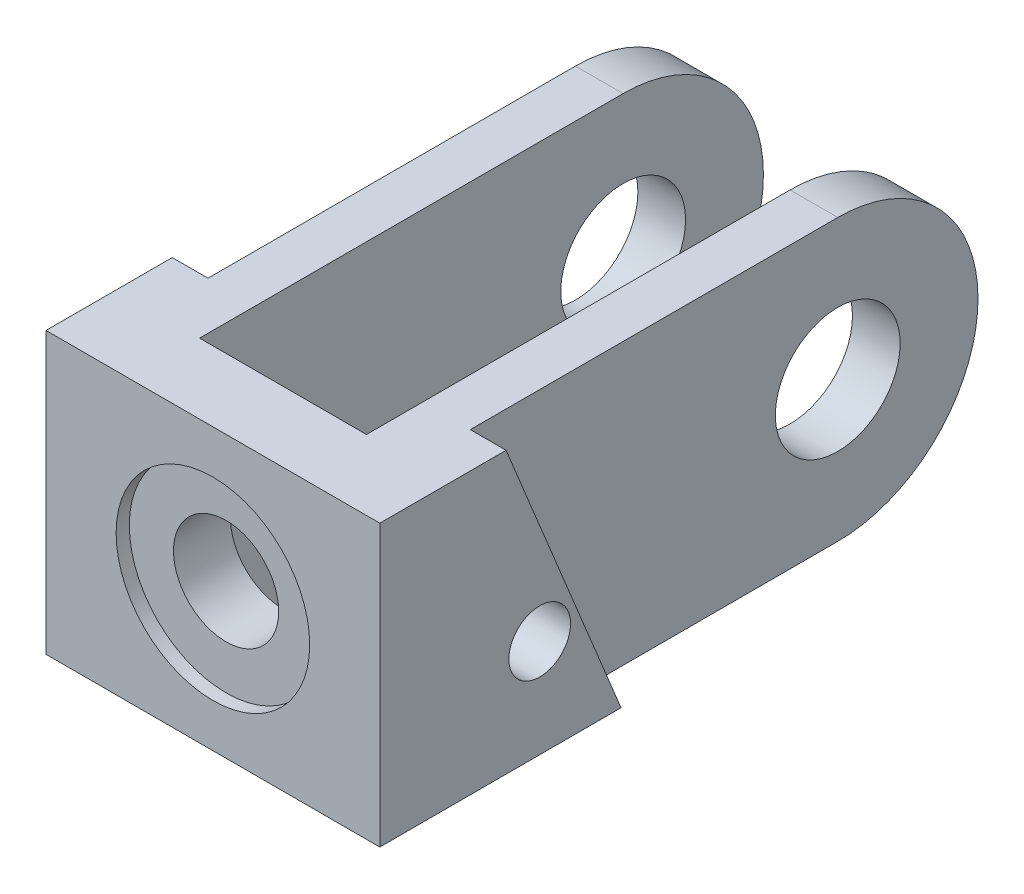
ISO-10303-21;
HEADER;
FILE_DESCRIPTION(('STEP AP214'),'2;1');
FILE_NAME('part.step','',(''),(''),'','','');
FILE_SCHEMA(('AUTOMOTIVE_DESIGN { 1 0 10303 214 1 1 1 1 }'));
ENDSEC;
DATA;
#1=APPLICATION_CONTEXT('core data for automotive mechanical design processes');
#2=APPLICATION_PROTOCOL_DEFINITION('international standard','automotive_design',2000,#1);
#3=PRODUCT_CONTEXT('',#1,'mechanical');
#4=PRODUCT('Part','Part','',(#3));
#5=PRODUCT_RELATED_PRODUCT_CATEGORY('part','',(#4));
#6=PRODUCT_DEFINITION_FORMATION('','',#4);
#7=PRODUCT_DEFINITION_CONTEXT('part definition',#1,'design');
#8=PRODUCT_DEFINITION('design','',#6,#7);
#9=PRODUCT_DEFINITION_SHAPE('','',#8);
#10=(LENGTH_UNIT() NAMED_UNIT(*) SI_UNIT(.MILLI.,.METRE.));
#11=(NAMED_UNIT(*) PLANE_ANGLE_UNIT() SI_UNIT($,.RADIAN.));
#12=(NAMED_UNIT(*) SI_UNIT($,.STERADIAN.) SOLID_ANGLE_UNIT());
#13=UNCERTAINTY_MEASURE_WITH_UNIT(LENGTH_MEASURE(1.E-05),#10,'distance_accuracy_value','');
#14=(GEOMETRIC_REPRESENTATION_CONTEXT(3) GLOBAL_UNCERTAINTY_ASSIGNED_CONTEXT((#13)) GLOBAL_UNIT_ASSIGNED_CONTEXT((#10,
#11,#12)) REPRESENTATION_CONTEXT('',''));
#15=CARTESIAN_POINT('',(0.,0.,0.));
#16=DIRECTION('',(0.,0.,1.));
#17=DIRECTION('',(1.,0.,0.));
#18=AXIS2_PLACEMENT_3D('',#15,#16,#17);
#19=CARTESIAN_POINT('',(0.,25.4,-114.808));
#20=DIRECTION('',(0.,0.,1.));
#21=DIRECTION('',(1.,0.,0.));
#22=AXIS2_PLACEMENT_3D('',#19,#20,#21);
#23=CYLINDRICAL_SURFACE('',#22,9.525);
#24=CARTESIAN_POINT('',(0.,25.4,-12.7));
#25=DIRECTION('',(0.,0.,-1.));
#26=DIRECTION('',(0.,1.,0.));
#27=AXIS2_PLACEMENT_3D('',#24,#25,#26);
#28=CIRCLE('',#27,9.525);
#29=CARTESIAN_POINT('',(0.,34.925,-12.7));
#30=VERTEX_POINT('',#29);
#31=EDGE_CURVE('E159',#30,#30,#28,.T.);
#32=ORIENTED_EDGE('',*,*,#31,.T.);
#33=EDGE_LOOP('',(#32));
#34=FACE_BOUND('',#33,.T.);
#35=CARTESIAN_POINT('',(0.,25.4,-2.3876));
#36=DIRECTION('',(0.,0.,1.));
#37=DIRECTION('',(1.,0.,0.));
#38=AXIS2_PLACEMENT_3D('',#35,#36,#37);
#39=CIRCLE('',#38,9.525);
#40=CARTESIAN_POINT('',(9.525,25.4,-2.3876));
#41=VERTEX_POINT('',#40);
#42=EDGE_CURVE('E39',#41,#41,#39,.F.);
#43=ORIENTED_EDGE('',*,*,#42,.F.);
#44=EDGE_LOOP('',(#43));
#45=FACE_BOUND('',#44,.T.);
#46=ADVANCED_FACE('F35',(#34,#45),#23,.F.);
#47=CARTESIAN_POINT('',(-23.749,0.,0.));
#48=DIRECTION('',(-1.,0.,0.));
#49=DIRECTION('',(0.,0.,-1.));
#50=AXIS2_PLACEMENT_3D('',#47,#48,#49);
#51=PLANE('',#50);
#52=CARTESIAN_POINT('',(-23.749,25.4,-89.408));
#53=DIRECTION('',(1.,0.,0.));
#54=DIRECTION('',(0.,0.,-1.));
#55=AXIS2_PLACEMENT_3D('',#52,#53,#54);
#56=CIRCLE('',#55,11.303);
#57=CARTESIAN_POINT('',(-23.749,25.4,-100.711));
#58=VERTEX_POINT('',#57);
#59=EDGE_CURVE('E294',#58,#58,#56,.T.);
#60=ORIENTED_EDGE('',*,*,#59,.T.);
#61=EDGE_LOOP('',(#60));
#62=FACE_BOUND('',#61,.T.);
#63=DIRECTION('',(0.,0.,-1.));
#64=VECTOR('',#63,1.);
#65=CARTESIAN_POINT('',(-23.749,0.,0.));
#66=LINE('',#65,#64);
#67=CARTESIAN_POINT('',(-23.749,0.,-43.688));
#68=VERTEX_POINT('',#67);
#69=CARTESIAN_POINT('',(-23.749,0.,-89.408));
#70=VERTEX_POINT('',#69);
#71=EDGE_CURVE('E169',#68,#70,#66,.T.);
#72=ORIENTED_EDGE('',*,*,#71,.F.);
#73=DIRECTION('',(0.,0.9252519052084,0.379353281135444));
#74=VECTOR('',#73,1.);
#75=CARTESIAN_POINT('',(-23.749,15.3343720571869,-37.4009074565534));
#76=LINE('',#75,#74);
#77=CARTESIAN_POINT('',(-23.749,50.8,-22.86));
#78=VERTEX_POINT('',#77);
#79=EDGE_CURVE('E157',#68,#78,#76,.T.);
#80=ORIENTED_EDGE('',*,*,#79,.T.);
#81=DIRECTION('',(0.,0.,-1.));
#82=VECTOR('',#81,1.);
#83=CARTESIAN_POINT('',(-23.749,50.8,0.));
#84=LINE('',#83,#82);
#85=CARTESIAN_POINT('',(-23.749,50.8,-89.408));
#86=VERTEX_POINT('',#85);
#87=EDGE_CURVE('E131',#78,#86,#84,.T.);
#88=ORIENTED_EDGE('',*,*,#87,.T.);
#89=CARTESIAN_POINT('',(-23.749,25.4,-89.408));
#90=DIRECTION('',(1.,0.,0.));
#91=DIRECTION('',(0.,0.,-1.));
#92=AXIS2_PLACEMENT_3D('',#89,#90,#91);
#93=CIRCLE('',#92,25.4);
#94=EDGE_CURVE('E175',#70,#86,#93,.T.);
#95=ORIENTED_EDGE('',*,*,#94,.F.);
#96=EDGE_LOOP('',(#72,#80,#88,#95));
#97=FACE_BOUND('',#96,.T.);
#98=ADVANCED_FACE('F173',(#62,#97),#51,.T.);
#99=CARTESIAN_POINT('',(15.113,0.,-12.7));
#100=DIRECTION('',(0.,0.,-1.));
#101=DIRECTION('',(0.,1.,0.));
#102=AXIS2_PLACEMENT_3D('',#99,#100,#101);
#103=PLANE('',#102);
#104=ORIENTED_EDGE('',*,*,#31,.F.);
#105=EDGE_LOOP('',(#104));
#106=FACE_BOUND('',#105,.T.);
#107=DIRECTION('',(-1.,0.,0.));
#108=VECTOR('',#107,1.);
#109=CARTESIAN_POINT('',(15.113,0.,-12.7));
#110=LINE('',#109,#108);
#111=CARTESIAN_POINT('',(15.113,0.,-12.7));
#112=VERTEX_POINT('',#111);
#113=CARTESIAN_POINT('',(-15.113,0.,-12.7));
#114=VERTEX_POINT('',#113);
#115=EDGE_CURVE('E271',#112,#114,#110,.T.);
#116=ORIENTED_EDGE('',*,*,#115,.T.);
#117=DIRECTION('',(0.,-1.,0.));
#118=VECTOR('',#117,1.);
#119=CARTESIAN_POINT('',(-15.113,0.,-12.7));
#120=LINE('',#119,#118);
#121=CARTESIAN_POINT('',(-15.113,50.8,-12.7));
#122=VERTEX_POINT('',#121);
#123=EDGE_CURVE('E181',#122,#114,#120,.T.);
#124=ORIENTED_EDGE('',*,*,#123,.F.);
#125=DIRECTION('',(-1.,0.,0.));
#126=VECTOR('',#125,1.);
#127=CARTESIAN_POINT('',(15.113,50.8,-12.7));
#128=LINE('',#127,#126);
#129=CARTESIAN_POINT('',(15.113,50.8,-12.7));
#130=VERTEX_POINT('',#129);
#131=EDGE_CURVE('E11',#130,#122,#128,.T.);
#132=ORIENTED_EDGE('',*,*,#131,.F.);
#133=DIRECTION('',(0.,-1.,0.));
#134=VECTOR('',#133,1.);
#135=CARTESIAN_POINT('',(15.113,0.,-12.7));
#136=LINE('',#135,#134);
#137=EDGE_CURVE('E258',#130,#112,#136,.T.);
#138=ORIENTED_EDGE('',*,*,#137,.T.);
#139=EDGE_LOOP('',(#116,#124,#132,#138));
#140=FACE_BOUND('',#139,.T.);
#141=ADVANCED_FACE('F37',(#106,#140),#103,.T.);
#142=CARTESIAN_POINT('',(15.113,50.8,0.));
#143=DIRECTION('',(0.,-1.,0.));
#144=DIRECTION('',(0.,0.,-1.));
#145=AXIS2_PLACEMENT_3D('',#142,#143,#144);
#146=PLANE('',#145);
#147=ORIENTED_EDGE('',*,*,#131,.T.);
#148=DIRECTION('',(0.,0.,-1.));
#149=VECTOR('',#148,1.);
#150=CARTESIAN_POINT('',(-15.113,50.8,0.));
#151=LINE('',#150,#149);
#152=CARTESIAN_POINT('',(-15.113,50.8,-89.408));
#153=VERTEX_POINT('',#152);
#154=EDGE_CURVE('E191',#122,#153,#151,.T.);
#155=ORIENTED_EDGE('',*,*,#154,.T.);
#156=DIRECTION('',(1.,0.,0.));
#157=VECTOR('',#156,1.);
#158=CARTESIAN_POINT('',(-23.749,50.8,-89.408));
#159=LINE('',#158,#157);
#160=EDGE_CURVE('E185',#86,#153,#159,.T.);
#161=ORIENTED_EDGE('',*,*,#160,.F.);
#162=ORIENTED_EDGE('',*,*,#87,.F.);
#163=DIRECTION('',(1.,0.,0.));
#164=VECTOR('',#163,1.);
#165=CARTESIAN_POINT('',(-30.226,50.8,-22.86));
#166=LINE('',#165,#164);
#167=CARTESIAN_POINT('',(-30.226,50.8,-22.86));
#168=VERTEX_POINT('',#167);
#169=EDGE_CURVE('E52',#168,#78,#166,.T.);
#170=ORIENTED_EDGE('',*,*,#169,.F.);
#171=DIRECTION('',(0.,0.,1.));
#172=VECTOR('',#171,1.);
#173=CARTESIAN_POINT('',(-30.226,50.8,0.));
#174=LINE('',#173,#172);
#175=CARTESIAN_POINT('',(-30.226,50.8,0.));
#176=VERTEX_POINT('',#175);
#177=EDGE_CURVE('E128',#168,#176,#174,.T.);
#178=ORIENTED_EDGE('',*,*,#177,.T.);
#179=DIRECTION('',(-1.,0.,0.));
#180=VECTOR('',#179,1.);
#181=CARTESIAN_POINT('',(15.113,50.8,0.));
#182=LINE('',#181,#180);
#183=CARTESIAN_POINT('',(30.226,50.8,0.));
#184=VERTEX_POINT('',#183);
#185=EDGE_CURVE('E44',#184,#176,#182,.T.);
#186=ORIENTED_EDGE('',*,*,#185,.F.);
#187=DIRECTION('',(0.,0.,1.));
#188=VECTOR('',#187,1.);
#189=CARTESIAN_POINT('',(30.226,50.8,0.));
#190=LINE('',#189,#188);
#191=CARTESIAN_POINT('',(30.226,50.8,-22.86));
#192=VERTEX_POINT('',#191);
#193=EDGE_CURVE('E197',#192,#184,#190,.T.);
#194=ORIENTED_EDGE('',*,*,#193,.F.);
#195=DIRECTION('',(-1.,0.,0.));
#196=VECTOR('',#195,1.);
#197=CARTESIAN_POINT('',(30.226,50.8,-22.86));
#198=LINE('',#197,#196);
#199=CARTESIAN_POINT('',(23.749,50.8,-22.86));
#200=VERTEX_POINT('',#199);
#201=EDGE_CURVE('E207',#192,#200,#198,.T.);
#202=ORIENTED_EDGE('',*,*,#201,.T.);
#203=DIRECTION('',(0.,0.,-1.));
#204=VECTOR('',#203,1.);
#205=CARTESIAN_POINT('',(23.749,50.8,0.));
#206=LINE('',#205,#204);
#207=CARTESIAN_POINT('',(23.749,50.8,-89.408));
#208=VERTEX_POINT('',#207);
#209=EDGE_CURVE('E215',#200,#208,#206,.T.);
#210=ORIENTED_EDGE('',*,*,#209,.T.);
#211=DIRECTION('',(-1.,0.,0.));
#212=VECTOR('',#211,1.);
#213=CARTESIAN_POINT('',(23.749,50.8,-89.408));
#214=LINE('',#213,#212);
#215=CARTESIAN_POINT('',(15.113,50.8,-89.408));
#216=VERTEX_POINT('',#215);
#217=EDGE_CURVE('E253',#208,#216,#214,.T.);
#218=ORIENTED_EDGE('',*,*,#217,.T.);
#219=DIRECTION('',(0.,0.,-1.));
#220=VECTOR('',#219,1.);
#221=CARTESIAN_POINT('',(15.113,50.8,0.));
#222=LINE('',#221,#220);
#223=EDGE_CURVE('E233',#130,#216,#222,.T.);
#224=ORIENTED_EDGE('',*,*,#223,.F.);
#225=EDGE_LOOP('',(#147,#155,#161,#162,#170,#178,#186,#194,#202,#210,#218,#224));
#226=FACE_BOUND('',#225,.T.);
#227=ADVANCED_FACE('F127',(#226),#146,.F.);
#228=CARTESIAN_POINT('',(15.113,0.,0.));
#229=DIRECTION('',(0.,0.,-1.));
#230=DIRECTION('',(0.,1.,0.));
#231=AXIS2_PLACEMENT_3D('',#228,#229,#230);
#232=PLANE('',#231);
#233=CARTESIAN_POINT('',(0.,25.4,0.));
#234=DIRECTION('',(0.,0.,1.));
#235=DIRECTION('',(1.,0.,0.));
#236=AXIS2_PLACEMENT_3D('',#233,#234,#235);
#237=CIRCLE('',#236,17.526);
#238=CARTESIAN_POINT('',(17.526,25.4,0.));
#239=VERTEX_POINT('',#238);
#240=EDGE_CURVE('E602',#239,#239,#237,.T.);
#241=ORIENTED_EDGE('',*,*,#240,.F.);
#242=EDGE_LOOP('',(#241));
#243=FACE_BOUND('',#242,.T.);
#244=ORIENTED_EDGE('',*,*,#185,.T.);
#245=DIRECTION('',(0.,-1.,0.));
#246=VECTOR('',#245,1.);
#247=CARTESIAN_POINT('',(-30.226,0.,0.));
#248=LINE('',#247,#246);
#249=CARTESIAN_POINT('',(-30.226,0.,0.));
#250=VERTEX_POINT('',#249);
#251=EDGE_CURVE('E142',#176,#250,#248,.T.);
#252=ORIENTED_EDGE('',*,*,#251,.T.);
#253=DIRECTION('',(-1.,0.,0.));
#254=VECTOR('',#253,1.);
#255=CARTESIAN_POINT('',(15.113,0.,0.));
#256=LINE('',#255,#254);
#257=CARTESIAN_POINT('',(30.226,0.,0.));
#258=VERTEX_POINT('',#257);
#259=EDGE_CURVE('E276',#258,#250,#256,.T.);
#260=ORIENTED_EDGE('',*,*,#259,.F.);
#261=DIRECTION('',(0.,-1.,0.));
#262=VECTOR('',#261,1.);
#263=CARTESIAN_POINT('',(30.226,0.,0.));
#264=LINE('',#263,#262);
#265=EDGE_CURVE('E200',#184,#258,#264,.T.);
#266=ORIENTED_EDGE('',*,*,#265,.F.);
#267=EDGE_LOOP('',(#244,#252,#260,#266));
#268=FACE_BOUND('',#267,.T.);
#269=ADVANCED_FACE('F320',(#243,#268),#232,.F.);
#270=CARTESIAN_POINT('',(15.113,0.,0.));
#271=DIRECTION('',(0.,1.,0.));
#272=DIRECTION('',(0.,0.,1.));
#273=AXIS2_PLACEMENT_3D('',#270,#271,#272);
#274=PLANE('',#273);
#275=ORIENTED_EDGE('',*,*,#259,.T.);
#276=DIRECTION('',(0.,0.,-1.));
#277=VECTOR('',#276,1.);
#278=CARTESIAN_POINT('',(-30.226,0.,0.));
#279=LINE('',#278,#277);
#280=CARTESIAN_POINT('',(-30.226,0.,-43.688));
#281=VERTEX_POINT('',#280);
#282=EDGE_CURVE('E146',#250,#281,#279,.T.);
#283=ORIENTED_EDGE('',*,*,#282,.T.);
#284=DIRECTION('',(1.,0.,0.));
#285=VECTOR('',#284,1.);
#286=CARTESIAN_POINT('',(-30.226,0.,-43.688));
#287=LINE('',#286,#285);
#288=EDGE_CURVE('E133',#281,#68,#287,.T.);
#289=ORIENTED_EDGE('',*,*,#288,.T.);
#290=ORIENTED_EDGE('',*,*,#71,.T.);
#291=DIRECTION('',(1.,0.,0.));
#292=VECTOR('',#291,1.);
#293=CARTESIAN_POINT('',(-23.749,0.,-89.408));
#294=LINE('',#293,#292);
#295=CARTESIAN_POINT('',(-15.113,0.,-89.408));
#296=VERTEX_POINT('',#295);
#297=EDGE_CURVE('E286',#70,#296,#294,.T.);
#298=ORIENTED_EDGE('',*,*,#297,.T.);
#299=DIRECTION('',(0.,0.,-1.));
#300=VECTOR('',#299,1.);
#301=CARTESIAN_POINT('',(-15.113,0.,0.));
#302=LINE('',#301,#300);
#303=EDGE_CURVE('E132',#114,#296,#302,.T.);
#304=ORIENTED_EDGE('',*,*,#303,.F.);
#305=ORIENTED_EDGE('',*,*,#115,.F.);
#306=DIRECTION('',(0.,0.,-1.));
#307=VECTOR('',#306,1.);
#308=CARTESIAN_POINT('',(15.113,0.,0.));
#309=LINE('',#308,#307);
#310=CARTESIAN_POINT('',(15.113,0.,-89.408));
#311=VERTEX_POINT('',#310);
#312=EDGE_CURVE('E223',#112,#311,#309,.T.);
#313=ORIENTED_EDGE('',*,*,#312,.T.);
#314=DIRECTION('',(-1.,0.,0.));
#315=VECTOR('',#314,1.);
#316=CARTESIAN_POINT('',(23.749,0.,-89.408));
#317=LINE('',#316,#315);
#318=CARTESIAN_POINT('',(23.749,0.,-89.408));
#319=VERTEX_POINT('',#318);
#320=EDGE_CURVE('E238',#319,#311,#317,.T.);
#321=ORIENTED_EDGE('',*,*,#320,.F.);
#322=DIRECTION('',(0.,0.,-1.));
#323=VECTOR('',#322,1.);
#324=CARTESIAN_POINT('',(23.749,0.,0.));
#325=LINE('',#324,#323);
#326=CARTESIAN_POINT('',(23.749,0.,-43.688));
#327=VERTEX_POINT('',#326);
#328=EDGE_CURVE('E252',#327,#319,#325,.T.);
#329=ORIENTED_EDGE('',*,*,#328,.F.);
#330=DIRECTION('',(-1.,0.,0.));
#331=VECTOR('',#330,1.);
#332=CARTESIAN_POINT('',(30.226,0.,-43.688));
#333=LINE('',#332,#331);
#334=CARTESIAN_POINT('',(30.226,0.,-43.688));
#335=VERTEX_POINT('',#334);
#336=EDGE_CURVE('E220',#335,#327,#333,.T.);
#337=ORIENTED_EDGE('',*,*,#336,.F.);
#338=DIRECTION('',(0.,0.,-1.));
#339=VECTOR('',#338,1.);
#340=CARTESIAN_POINT('',(30.226,0.,0.));
#341=LINE('',#340,#339);
#342=EDGE_CURVE('E203',#258,#335,#341,.T.);
#343=ORIENTED_EDGE('',*,*,#342,.F.);
#344=EDGE_LOOP('',(#275,#283,#289,#290,#298,#304,#305,#313,#321,#329,#337,#343));
#345=FACE_BOUND('',#344,.T.);
#346=ADVANCED_FACE('F166',(#345),#274,.F.);
#347=CARTESIAN_POINT('',(23.749,25.4,-89.408));
#348=DIRECTION('',(-1.,0.,0.));
#349=DIRECTION('',(0.,0.,1.));
#350=AXIS2_PLACEMENT_3D('',#347,#348,#349);
#351=CYLINDRICAL_SURFACE('',#350,25.4);
#352=CARTESIAN_POINT('',(15.113,25.4,-89.408));
#353=DIRECTION('',(1.,0.,0.));
#354=DIRECTION('',(0.,0.,-1.));
#355=AXIS2_PLACEMENT_3D('',#352,#353,#354);
#356=CIRCLE('',#355,25.4);
#357=EDGE_CURVE('E227',#311,#216,#356,.T.);
#358=ORIENTED_EDGE('',*,*,#357,.T.);
#359=ORIENTED_EDGE('',*,*,#217,.F.);
#360=CARTESIAN_POINT('',(23.749,25.4,-89.408));
#361=DIRECTION('',(1.,0.,0.));
#362=DIRECTION('',(0.,0.,-1.));
#363=AXIS2_PLACEMENT_3D('',#360,#361,#362);
#364=CIRCLE('',#363,25.4);
#365=EDGE_CURVE('E262',#319,#208,#364,.T.);
#366=ORIENTED_EDGE('',*,*,#365,.F.);
#367=ORIENTED_EDGE('',*,*,#320,.T.);
#368=EDGE_LOOP('',(#358,#359,#366,#367));
#369=FACE_BOUND('',#368,.T.);
#370=ADVANCED_FACE('F311',(#369),#351,.T.);
#371=CARTESIAN_POINT('',(23.749,17.78,-28.956));
#372=DIRECTION('',(-1.,0.,0.));
#373=DIRECTION('',(0.,0.,1.));
#374=AXIS2_PLACEMENT_3D('',#371,#372,#373);
#375=CYLINDRICAL_SURFACE('',#374,5.588);
#376=CARTESIAN_POINT('',(15.113,17.78,-28.956));
#377=DIRECTION('',(1.,0.,0.));
#378=DIRECTION('',(0.,0.,-1.));
#379=AXIS2_PLACEMENT_3D('',#376,#377,#378);
#380=CIRCLE('',#379,5.588);
#381=CARTESIAN_POINT('',(15.113,17.78,-34.544));
#382=VERTEX_POINT('',#381);
#383=EDGE_CURVE('E247',#382,#382,#380,.T.);
#384=ORIENTED_EDGE('',*,*,#383,.F.);
#385=EDGE_LOOP('',(#384));
#386=FACE_BOUND('',#385,.T.);
#387=CARTESIAN_POINT('',(30.226,17.78,-28.956));
#388=DIRECTION('',(1.,0.,0.));
#389=DIRECTION('',(0.,0.,-1.));
#390=AXIS2_PLACEMENT_3D('',#387,#388,#389);
#391=CIRCLE('',#390,5.588);
#392=CARTESIAN_POINT('',(30.226,17.78,-34.544));
#393=VERTEX_POINT('',#392);
#394=EDGE_CURVE('E194',#393,#393,#391,.T.);
#395=ORIENTED_EDGE('',*,*,#394,.T.);
#396=EDGE_LOOP('',(#395));
#397=FACE_BOUND('',#396,.T.);
#398=ADVANCED_FACE('F375',(#386,#397),#375,.F.);
#399=CARTESIAN_POINT('',(23.749,25.4,-89.408));
#400=DIRECTION('',(-1.,0.,0.));
#401=DIRECTION('',(0.,0.,1.));
#402=AXIS2_PLACEMENT_3D('',#399,#400,#401);
#403=CYLINDRICAL_SURFACE('',#402,11.303);
#404=CARTESIAN_POINT('',(23.749,25.4,-89.408));
#405=DIRECTION('',(1.,0.,0.));
#406=DIRECTION('',(0.,0.,-1.));
#407=AXIS2_PLACEMENT_3D('',#404,#405,#406);
#408=CIRCLE('',#407,11.303);
#409=CARTESIAN_POINT('',(23.749,25.4,-100.711));
#410=VERTEX_POINT('',#409);
#411=EDGE_CURVE('E244',#410,#410,#408,.T.);
#412=ORIENTED_EDGE('',*,*,#411,.T.);
#413=EDGE_LOOP('',(#412));
#414=FACE_BOUND('',#413,.T.);
#415=CARTESIAN_POINT('',(15.113,25.4,-89.408));
#416=DIRECTION('',(1.,0.,0.));
#417=DIRECTION('',(0.,0.,-1.));
#418=AXIS2_PLACEMENT_3D('',#415,#416,#417);
#419=CIRCLE('',#418,11.303);
#420=CARTESIAN_POINT('',(15.113,25.4,-100.711));
#421=VERTEX_POINT('',#420);
#422=EDGE_CURVE('E250',#421,#421,#419,.T.);
#423=ORIENTED_EDGE('',*,*,#422,.F.);
#424=EDGE_LOOP('',(#423));
#425=FACE_BOUND('',#424,.T.);
#426=ADVANCED_FACE('F370',(#414,#425),#403,.F.);
#427=CARTESIAN_POINT('',(23.749,0.,0.));
#428=DIRECTION('',(1.,0.,0.));
#429=DIRECTION('',(0.,0.,-1.));
#430=AXIS2_PLACEMENT_3D('',#427,#428,#429);
#431=PLANE('',#430);
#432=DIRECTION('',(0.,0.9252519052084,0.379353281135444));
#433=VECTOR('',#432,1.);
#434=CARTESIAN_POINT('',(23.749,15.3343720571869,-37.4009074565534));
#435=LINE('',#434,#433);
#436=EDGE_CURVE('E60',#327,#200,#435,.T.);
#437=ORIENTED_EDGE('',*,*,#436,.F.);
#438=ORIENTED_EDGE('',*,*,#328,.T.);
#439=ORIENTED_EDGE('',*,*,#365,.T.);
#440=ORIENTED_EDGE('',*,*,#209,.F.);
#441=EDGE_LOOP('',(#437,#438,#439,#440));
#442=FACE_BOUND('',#441,.T.);
#443=ORIENTED_EDGE('',*,*,#411,.F.);
#444=EDGE_LOOP('',(#443));
#445=FACE_BOUND('',#444,.T.);
#446=ADVANCED_FACE('F367',(#442,#445),#431,.T.);
#447=CARTESIAN_POINT('',(15.113,0.,0.));
#448=DIRECTION('',(1.,0.,0.));
#449=DIRECTION('',(0.,0.,-1.));
#450=AXIS2_PLACEMENT_3D('',#447,#448,#449);
#451=PLANE('',#450);
#452=ORIENTED_EDGE('',*,*,#137,.F.);
#453=ORIENTED_EDGE('',*,*,#223,.T.);
#454=ORIENTED_EDGE('',*,*,#357,.F.);
#455=ORIENTED_EDGE('',*,*,#312,.F.);
#456=EDGE_LOOP('',(#452,#453,#454,#455));
#457=FACE_BOUND('',#456,.T.);
#458=ORIENTED_EDGE('',*,*,#383,.T.);
#459=EDGE_LOOP('',(#458));
#460=FACE_BOUND('',#459,.T.);
#461=ORIENTED_EDGE('',*,*,#422,.T.);
#462=EDGE_LOOP('',(#461));
#463=FACE_BOUND('',#462,.T.);
#464=ADVANCED_FACE('F308',(#457,#460,#463),#451,.F.);
#465=CARTESIAN_POINT('',(30.226,15.3343720571869,-37.4009074565534));
#466=DIRECTION('',(0.,-0.379353281135444,0.9252519052084));
#467=DIRECTION('',(0.,-0.9252519052084,-0.379353281135444));
#468=AXIS2_PLACEMENT_3D('',#465,#466,#467);
#469=PLANE('',#468);
#470=ORIENTED_EDGE('',*,*,#436,.T.);
#471=ORIENTED_EDGE('',*,*,#201,.F.);
#472=DIRECTION('',(0.,0.9252519052084,0.379353281135444));
#473=VECTOR('',#472,1.);
#474=CARTESIAN_POINT('',(30.226,15.3343720571869,-37.4009074565534));
#475=LINE('',#474,#473);
#476=EDGE_CURVE('E205',#335,#192,#475,.T.);
#477=ORIENTED_EDGE('',*,*,#476,.F.);
#478=ORIENTED_EDGE('',*,*,#336,.T.);
#479=EDGE_LOOP('',(#470,#471,#477,#478));
#480=FACE_BOUND('',#479,.T.);
#481=ADVANCED_FACE('F314',(#480),#469,.F.);
#482=CARTESIAN_POINT('',(30.226,0.,0.));
#483=DIRECTION('',(1.,0.,0.));
#484=DIRECTION('',(0.,0.,-1.));
#485=AXIS2_PLACEMENT_3D('',#482,#483,#484);
#486=PLANE('',#485);
#487=ORIENTED_EDGE('',*,*,#394,.F.);
#488=EDGE_LOOP('',(#487));
#489=FACE_BOUND('',#488,.T.);
#490=ORIENTED_EDGE('',*,*,#193,.T.);
#491=ORIENTED_EDGE('',*,*,#265,.T.);
#492=ORIENTED_EDGE('',*,*,#342,.T.);
#493=ORIENTED_EDGE('',*,*,#476,.T.);
#494=EDGE_LOOP('',(#490,#491,#492,#493));
#495=FACE_BOUND('',#494,.T.);
#496=ADVANCED_FACE('F317',(#489,#495),#486,.T.);
#497=CARTESIAN_POINT('',(-15.113,0.,0.));
#498=DIRECTION('',(-1.,0.,0.));
#499=DIRECTION('',(0.,0.,-1.));
#500=AXIS2_PLACEMENT_3D('',#497,#498,#499);
#501=PLANE('',#500);
#502=CARTESIAN_POINT('',(-15.113,17.78,-28.956));
#503=DIRECTION('',(1.,0.,0.));
#504=DIRECTION('',(0.,0.,-1.));
#505=AXIS2_PLACEMENT_3D('',#502,#503,#504);
#506=CIRCLE('',#505,5.588);
#507=CARTESIAN_POINT('',(-15.113,17.78,-34.544));
#508=VERTEX_POINT('',#507);
#509=EDGE_CURVE('E178',#508,#508,#506,.T.);
#510=ORIENTED_EDGE('',*,*,#509,.F.);
#511=EDGE_LOOP('',(#510));
#512=FACE_BOUND('',#511,.T.);
#513=CARTESIAN_POINT('',(-15.113,25.4,-89.408));
#514=DIRECTION('',(1.,0.,0.));
#515=DIRECTION('',(0.,0.,-1.));
#516=AXIS2_PLACEMENT_3D('',#513,#514,#515);
#517=CIRCLE('',#516,11.303);
#518=CARTESIAN_POINT('',(-15.113,25.4,-100.711));
#519=VERTEX_POINT('',#518);
#520=EDGE_CURVE('E176',#519,#519,#517,.T.);
#521=ORIENTED_EDGE('',*,*,#520,.F.);
#522=EDGE_LOOP('',(#521));
#523=FACE_BOUND('',#522,.T.);
#524=ORIENTED_EDGE('',*,*,#154,.F.);
#525=ORIENTED_EDGE('',*,*,#123,.T.);
#526=ORIENTED_EDGE('',*,*,#303,.T.);
#527=CARTESIAN_POINT('',(-15.113,25.4,-89.408));
#528=DIRECTION('',(1.,0.,0.));
#529=DIRECTION('',(0.,0.,-1.));
#530=AXIS2_PLACEMENT_3D('',#527,#528,#529);
#531=CIRCLE('',#530,25.4);
#532=EDGE_CURVE('E288',#296,#153,#531,.T.);
#533=ORIENTED_EDGE('',*,*,#532,.T.);
#534=EDGE_LOOP('',(#524,#525,#526,#533));
#535=FACE_BOUND('',#534,.T.);
#536=ADVANCED_FACE('F284',(#512,#523,#535),#501,.F.);
#537=CARTESIAN_POINT('',(-23.749,17.78,-28.956));
#538=DIRECTION('',(1.,0.,0.));
#539=DIRECTION('',(0.,0.,-1.));
#540=AXIS2_PLACEMENT_3D('',#537,#538,#539);
#541=CYLINDRICAL_SURFACE('',#540,5.588);
#542=ORIENTED_EDGE('',*,*,#509,.T.);
#543=EDGE_LOOP('',(#542));
#544=FACE_BOUND('',#543,.T.);
#545=CARTESIAN_POINT('',(-30.226,17.78,-28.956));
#546=DIRECTION('',(1.,0.,0.));
#547=DIRECTION('',(0.,0.,-1.));
#548=AXIS2_PLACEMENT_3D('',#545,#546,#547);
#549=CIRCLE('',#548,5.588);
#550=CARTESIAN_POINT('',(-30.226,17.78,-34.544));
#551=VERTEX_POINT('',#550);
#552=EDGE_CURVE('E143',#551,#551,#549,.T.);
#553=ORIENTED_EDGE('',*,*,#552,.F.);
#554=EDGE_LOOP('',(#553));
#555=FACE_BOUND('',#554,.T.);
#556=ADVANCED_FACE('F352',(#544,#555),#541,.F.);
#557=CARTESIAN_POINT('',(-23.749,25.4,-89.408));
#558=DIRECTION('',(1.,0.,0.));
#559=DIRECTION('',(0.,0.,-1.));
#560=AXIS2_PLACEMENT_3D('',#557,#558,#559);
#561=CYLINDRICAL_SURFACE('',#560,25.4);
#562=ORIENTED_EDGE('',*,*,#532,.F.);
#563=ORIENTED_EDGE('',*,*,#297,.F.);
#564=ORIENTED_EDGE('',*,*,#94,.T.);
#565=ORIENTED_EDGE('',*,*,#160,.T.);
#566=EDGE_LOOP('',(#562,#563,#564,#565));
#567=FACE_BOUND('',#566,.T.);
#568=ADVANCED_FACE('F306',(#567),#561,.T.);
#569=CARTESIAN_POINT('',(-23.749,25.4,-89.408));
#570=DIRECTION('',(1.,0.,0.));
#571=DIRECTION('',(0.,0.,-1.));
#572=AXIS2_PLACEMENT_3D('',#569,#570,#571);
#573=CYLINDRICAL_SURFACE('',#572,11.303);
#574=ORIENTED_EDGE('',*,*,#59,.F.);
#575=EDGE_LOOP('',(#574));
#576=FACE_BOUND('',#575,.T.);
#577=ORIENTED_EDGE('',*,*,#520,.T.);
#578=EDGE_LOOP('',(#577));
#579=FACE_BOUND('',#578,.T.);
#580=ADVANCED_FACE('F348',(#576,#579),#573,.F.);
#581=CARTESIAN_POINT('',(-30.226,15.3343720571869,-37.4009074565534));
#582=DIRECTION('',(0.,0.379353281135444,-0.9252519052084));
#583=DIRECTION('',(0.,0.9252519052084,0.379353281135444));
#584=AXIS2_PLACEMENT_3D('',#581,#582,#583);
#585=PLANE('',#584);
#586=ORIENTED_EDGE('',*,*,#79,.F.);
#587=ORIENTED_EDGE('',*,*,#288,.F.);
#588=DIRECTION('',(0.,0.9252519052084,0.379353281135444));
#589=VECTOR('',#588,1.);
#590=CARTESIAN_POINT('',(-30.226,15.3343720571869,-37.4009074565534));
#591=LINE('',#590,#589);
#592=EDGE_CURVE('E139',#281,#168,#591,.T.);
#593=ORIENTED_EDGE('',*,*,#592,.T.);
#594=ORIENTED_EDGE('',*,*,#169,.T.);
#595=EDGE_LOOP('',(#586,#587,#593,#594));
#596=FACE_BOUND('',#595,.T.);
#597=ADVANCED_FACE('F145',(#596),#585,.T.);
#598=CARTESIAN_POINT('',(-30.226,0.,0.));
#599=DIRECTION('',(-1.,0.,0.));
#600=DIRECTION('',(0.,0.,-1.));
#601=AXIS2_PLACEMENT_3D('',#598,#599,#600);
#602=PLANE('',#601);
#603=ORIENTED_EDGE('',*,*,#552,.T.);
#604=EDGE_LOOP('',(#603));
#605=FACE_BOUND('',#604,.T.);
#606=ORIENTED_EDGE('',*,*,#177,.F.);
#607=ORIENTED_EDGE('',*,*,#592,.F.);
#608=ORIENTED_EDGE('',*,*,#282,.F.);
#609=ORIENTED_EDGE('',*,*,#251,.F.);
#610=EDGE_LOOP('',(#606,#607,#608,#609));
#611=FACE_BOUND('',#610,.T.);
#612=ADVANCED_FACE('F137',(#605,#611),#602,.T.);
#613=CARTESIAN_POINT('',(0.,25.4,-2.3876));
#614=DIRECTION('',(0.,0.,1.));
#615=DIRECTION('',(1.,0.,0.));
#616=AXIS2_PLACEMENT_3D('',#613,#614,#615);
#617=PLANE('',#616);
#618=CARTESIAN_POINT('',(0.,25.4,-2.3876));
#619=DIRECTION('',(0.,0.,1.));
#620=DIRECTION('',(1.,0.,0.));
#621=AXIS2_PLACEMENT_3D('',#618,#619,#620);
#622=CIRCLE('',#621,17.526);
#623=CARTESIAN_POINT('',(17.526,25.4,-2.3876));
#624=VERTEX_POINT('',#623);
#625=EDGE_CURVE('E600',#624,#624,#622,.T.);
#626=ORIENTED_EDGE('',*,*,#625,.T.);
#627=EDGE_LOOP('',(#626));
#628=FACE_BOUND('',#627,.T.);
#629=ORIENTED_EDGE('',*,*,#42,.T.);
#630=EDGE_LOOP('',(#629));
#631=FACE_BOUND('',#630,.T.);
#632=ADVANCED_FACE('F345',(#628,#631),#617,.T.);
#633=CARTESIAN_POINT('',(0.,25.4,-2.3876));
#634=DIRECTION('',(0.,0.,1.));
#635=DIRECTION('',(1.,0.,0.));
#636=AXIS2_PLACEMENT_3D('',#633,#634,#635);
#637=CYLINDRICAL_SURFACE('',#636,17.526);
#638=ORIENTED_EDGE('',*,*,#625,.F.);
#639=EDGE_LOOP('',(#638));
#640=FACE_BOUND('',#639,.T.);
#641=ORIENTED_EDGE('',*,*,#240,.T.);
#642=EDGE_LOOP('',(#641));
#643=FACE_BOUND('',#642,.T.);
#644=ADVANCED_FACE('F341',(#640,#643),#637,.F.);
#645=CLOSED_SHELL('',(#46,#98,#141,#227,#269,#346,#370,#398,#426,#446,#464,#481,#496,#536,#556,
#568,#580,#597,#612,#632,#644));
#646=MANIFOLD_SOLID_BREP('B2',#645);
#647=ADVANCED_BREP_SHAPE_REPRESENTATION('',(#18,#646),#14);
#648=SHAPE_DEFINITION_REPRESENTATION(#9,#647);
ENDSEC;
END-ISO-10303-21;
